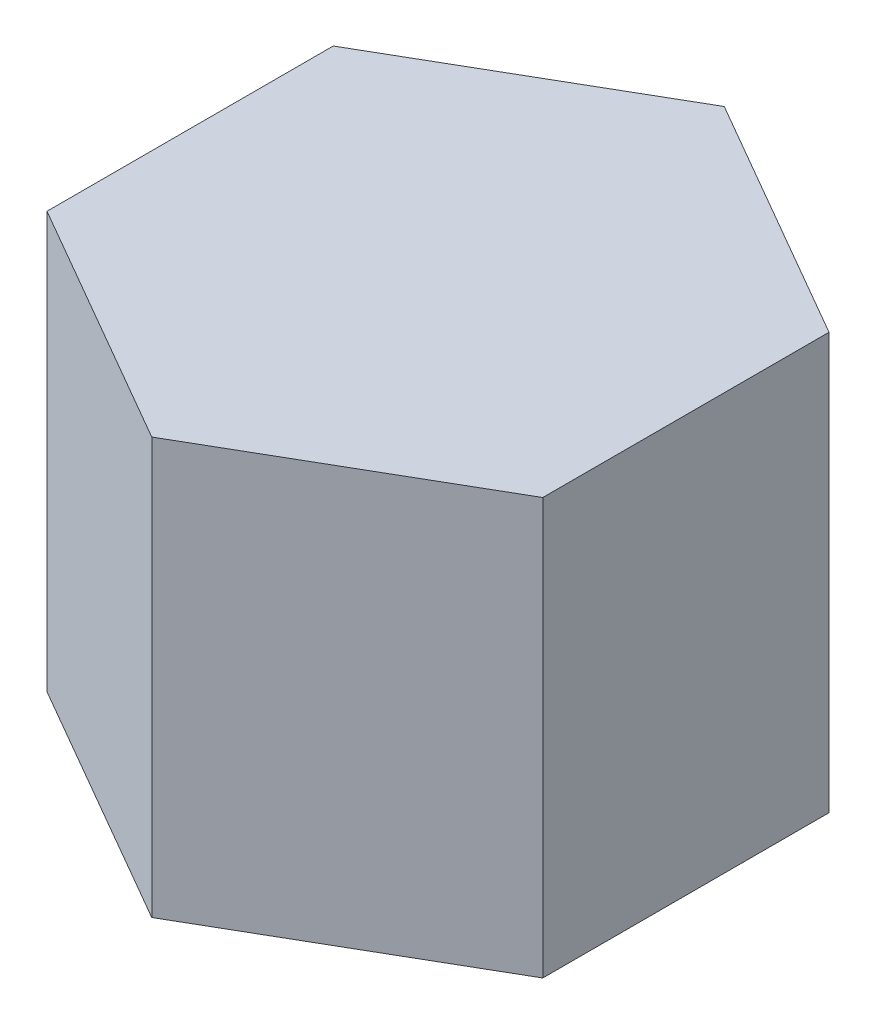
ISO-10303-21;
HEADER;
FILE_DESCRIPTION(('STEP AP214'),'2;1');
FILE_NAME('part.step','',(''),(''),'','','');
FILE_SCHEMA(('AUTOMOTIVE_DESIGN { 1 0 10303 214 1 1 1 1 }'));
ENDSEC;
DATA;
#1=APPLICATION_CONTEXT('core data for automotive mechanical design processes');
#2=APPLICATION_PROTOCOL_DEFINITION('international standard','automotive_design',2000,#1);
#3=PRODUCT_CONTEXT('',#1,'mechanical');
#4=PRODUCT('Part','Part','',(#3));
#5=PRODUCT_RELATED_PRODUCT_CATEGORY('part','',(#4));
#6=PRODUCT_DEFINITION_FORMATION('','',#4);
#7=PRODUCT_DEFINITION_CONTEXT('part definition',#1,'design');
#8=PRODUCT_DEFINITION('design','',#6,#7);
#9=PRODUCT_DEFINITION_SHAPE('','',#8);
#10=(LENGTH_UNIT() NAMED_UNIT(*) SI_UNIT(.MILLI.,.METRE.));
#11=(NAMED_UNIT(*) PLANE_ANGLE_UNIT() SI_UNIT($,.RADIAN.));
#12=(NAMED_UNIT(*) SI_UNIT($,.STERADIAN.) SOLID_ANGLE_UNIT());
#13=UNCERTAINTY_MEASURE_WITH_UNIT(LENGTH_MEASURE(1.E-05),#10,'distance_accuracy_value','');
#14=(GEOMETRIC_REPRESENTATION_CONTEXT(3) GLOBAL_UNCERTAINTY_ASSIGNED_CONTEXT((#13)) GLOBAL_UNIT_ASSIGNED_CONTEXT((#10,
#11,#12)) REPRESENTATION_CONTEXT('',''));
#15=CARTESIAN_POINT('',(0.,0.,0.));
#16=DIRECTION('',(0.,0.,1.));
#17=DIRECTION('',(1.,0.,0.));
#18=AXIS2_PLACEMENT_3D('',#15,#16,#17);
#19=CARTESIAN_POINT('',(202.839551417382,-147.556598747966,287.351844201572));
#20=DIRECTION('',(-0.499999999999943,0.,-0.866025403784471));
#21=DIRECTION('',(-0.866025403784471,0.,0.499999999999943));
#22=AXIS2_PLACEMENT_3D('',#19,#20,#21);
#23=PLANE('',#22);
#24=CARTESIAN_POINT('',(203.142660308706,-147.047793579175,287.176844201572));
#25=DIRECTION('',(-0.866025403784471,0.,0.499999999999943));
#26=VECTOR('',#25,1.);
#27=LINE('',#24,#26);
#28=CARTESIAN_POINT('',(203.142660308706,-147.047793579175,287.176844201572));
#29=VERTEX_POINT('',#28);
#30=CARTESIAN_POINT('',(202.839551417382,-147.047793579175,287.351844201572));
#31=VERTEX_POINT('',#30);
#32=EDGE_CURVE('E170',#29,#31,#27,.T.);
#33=ORIENTED_EDGE('',*,*,#32,.T.);
#34=CARTESIAN_POINT('',(202.839551417382,-147.556598747966,287.351844201572));
#35=DIRECTION('',(0.,1.,0.));
#36=VECTOR('',#35,1.);
#37=LINE('',#34,#36);
#38=CARTESIAN_POINT('',(202.839551417382,-147.556598747966,287.351844201572));
#39=VERTEX_POINT('',#38);
#40=EDGE_CURVE('E35',#39,#31,#37,.T.);
#41=ORIENTED_EDGE('',*,*,#40,.F.);
#42=CARTESIAN_POINT('',(203.142660308706,-147.556598747966,287.176844201572));
#43=DIRECTION('',(-0.866025403784471,0.,0.499999999999943));
#44=VECTOR('',#43,1.);
#45=LINE('',#42,#44);
#46=CARTESIAN_POINT('',(203.142660308706,-147.556598747966,287.176844201572));
#47=VERTEX_POINT('',#46);
#48=EDGE_CURVE('E159',#47,#39,#45,.T.);
#49=ORIENTED_EDGE('',*,*,#48,.F.);
#50=CARTESIAN_POINT('',(203.142660308706,-147.556598747966,287.176844201572));
#51=DIRECTION('',(0.,1.,0.));
#52=VECTOR('',#51,1.);
#53=LINE('',#50,#52);
#54=EDGE_CURVE('E10',#47,#29,#53,.T.);
#55=ORIENTED_EDGE('',*,*,#54,.T.);
#56=EDGE_LOOP('',(#33,#41,#49,#55));
#57=FACE_BOUND('',#56,.T.);
#58=ADVANCED_FACE('F16',(#57),#23,.F.);
#59=CARTESIAN_POINT('',(203.142660308706,-147.556598747966,291.594471220494));
#60=DIRECTION('',(-1.,0.,0.));
#61=DIRECTION('',(0.,-1.,0.));
#62=AXIS2_PLACEMENT_3D('',#59,#60,#61);
#63=PLANE('',#62);
#64=CARTESIAN_POINT('',(203.142660308706,-147.047793579175,286.826844201572));
#65=DIRECTION('',(0.,0.,1.));
#66=VECTOR('',#65,1.);
#67=LINE('',#64,#66);
#68=CARTESIAN_POINT('',(203.142660308706,-147.047793579175,286.826844201572));
#69=VERTEX_POINT('',#68);
#70=EDGE_CURVE('E167',#69,#29,#67,.T.);
#71=ORIENTED_EDGE('',*,*,#70,.T.);
#72=ORIENTED_EDGE('',*,*,#54,.F.);
#73=CARTESIAN_POINT('',(203.142660308706,-147.556598747966,286.826844201572));
#74=DIRECTION('',(0.,0.,1.));
#75=VECTOR('',#74,1.);
#76=LINE('',#73,#75);
#77=CARTESIAN_POINT('',(203.142660308706,-147.556598747966,286.826844201572));
#78=VERTEX_POINT('',#77);
#79=EDGE_CURVE('E156',#78,#47,#76,.T.);
#80=ORIENTED_EDGE('',*,*,#79,.F.);
#81=CARTESIAN_POINT('',(203.142660308706,-147.556598747966,286.826844201572));
#82=DIRECTION('',(0.,1.,0.));
#83=VECTOR('',#82,1.);
#84=LINE('',#81,#83);
#85=EDGE_CURVE('E27',#78,#69,#84,.T.);
#86=ORIENTED_EDGE('',*,*,#85,.T.);
#87=EDGE_LOOP('',(#71,#72,#80,#86));
#88=FACE_BOUND('',#87,.T.);
#89=ADVANCED_FACE('F189',(#88),#63,.F.);
#90=CARTESIAN_POINT('',(203.142660308706,-147.556598747966,286.826844201572));
#91=DIRECTION('',(-0.499999999999978,0.,0.866025403784452));
#92=DIRECTION('',(0.866025403784452,0.,0.499999999999978));
#93=AXIS2_PLACEMENT_3D('',#90,#91,#92);
#94=PLANE('',#93);
#95=CARTESIAN_POINT('',(202.839551417382,-147.047793579175,286.651844201572));
#96=DIRECTION('',(0.866025403784452,0.,0.499999999999978));
#97=VECTOR('',#96,1.);
#98=LINE('',#95,#97);
#99=CARTESIAN_POINT('',(202.839551417382,-147.047793579175,286.651844201572));
#100=VERTEX_POINT('',#99);
#101=EDGE_CURVE('E163',#100,#69,#98,.T.);
#102=ORIENTED_EDGE('',*,*,#101,.T.);
#103=ORIENTED_EDGE('',*,*,#85,.F.);
#104=CARTESIAN_POINT('',(202.839551417382,-147.556598747966,286.651844201572));
#105=DIRECTION('',(0.866025403784452,0.,0.499999999999978));
#106=VECTOR('',#105,1.);
#107=LINE('',#104,#106);
#108=CARTESIAN_POINT('',(202.839551417382,-147.556598747966,286.651844201572));
#109=VERTEX_POINT('',#108);
#110=EDGE_CURVE('E106',#109,#78,#107,.T.);
#111=ORIENTED_EDGE('',*,*,#110,.F.);
#112=CARTESIAN_POINT('',(202.839551417382,-147.556598747966,286.651844201572));
#113=DIRECTION('',(0.,1.,0.));
#114=VECTOR('',#113,1.);
#115=LINE('',#112,#114);
#116=EDGE_CURVE('E94',#109,#100,#115,.T.);
#117=ORIENTED_EDGE('',*,*,#116,.T.);
#118=EDGE_LOOP('',(#102,#103,#111,#117));
#119=FACE_BOUND('',#118,.T.);
#120=ADVANCED_FACE('F198',(#119),#94,.F.);
#121=CARTESIAN_POINT('',(202.839551417382,-147.556598747966,286.651844201572));
#122=DIRECTION('',(0.499999999999978,0.,0.866025403784452));
#123=DIRECTION('',(0.866025403784452,0.,-0.499999999999978));
#124=AXIS2_PLACEMENT_3D('',#121,#122,#123);
#125=PLANE('',#124);
#126=CARTESIAN_POINT('',(202.536442526057,-147.047793579175,286.826844201572));
#127=DIRECTION('',(0.866025403784452,0.,-0.499999999999978));
#128=VECTOR('',#127,1.);
#129=LINE('',#126,#128);
#130=CARTESIAN_POINT('',(202.536442526057,-147.047793579175,286.826844201572));
#131=VERTEX_POINT('',#130);
#132=EDGE_CURVE('E162',#131,#100,#129,.T.);
#133=ORIENTED_EDGE('',*,*,#132,.T.);
#134=ORIENTED_EDGE('',*,*,#116,.F.);
#135=CARTESIAN_POINT('',(202.536442526057,-147.556598747966,286.826844201572));
#136=DIRECTION('',(0.866025403784452,0.,-0.499999999999978));
#137=VECTOR('',#136,1.);
#138=LINE('',#135,#137);
#139=CARTESIAN_POINT('',(202.536442526057,-147.556598747966,286.826844201572));
#140=VERTEX_POINT('',#139);
#141=EDGE_CURVE('E98',#140,#109,#138,.T.);
#142=ORIENTED_EDGE('',*,*,#141,.F.);
#143=CARTESIAN_POINT('',(202.536442526057,-147.556598747966,286.826844201572));
#144=DIRECTION('',(0.,1.,0.));
#145=VECTOR('',#144,1.);
#146=LINE('',#143,#145);
#147=EDGE_CURVE('E79',#140,#131,#146,.T.);
#148=ORIENTED_EDGE('',*,*,#147,.T.);
#149=EDGE_LOOP('',(#133,#134,#142,#148));
#150=FACE_BOUND('',#149,.T.);
#151=ADVANCED_FACE('F100',(#150),#125,.F.);
#152=CARTESIAN_POINT('',(202.536442526057,-147.556598747966,291.594471220494));
#153=DIRECTION('',(1.,0.,0.));
#154=DIRECTION('',(0.,1.,0.));
#155=AXIS2_PLACEMENT_3D('',#152,#153,#154);
#156=PLANE('',#155);
#157=CARTESIAN_POINT('',(202.536442526057,-147.047793579175,287.176844201572));
#158=DIRECTION('',(0.,0.,-1.));
#159=VECTOR('',#158,1.);
#160=LINE('',#157,#159);
#161=CARTESIAN_POINT('',(202.536442526057,-147.047793579175,287.176844201572));
#162=VERTEX_POINT('',#161);
#163=EDGE_CURVE('E88',#162,#131,#160,.T.);
#164=ORIENTED_EDGE('',*,*,#163,.T.);
#165=ORIENTED_EDGE('',*,*,#147,.F.);
#166=CARTESIAN_POINT('',(202.536442526057,-147.556598747966,287.176844201572));
#167=DIRECTION('',(0.,0.,-1.));
#168=VECTOR('',#167,1.);
#169=LINE('',#166,#168);
#170=CARTESIAN_POINT('',(202.536442526057,-147.556598747966,287.176844201572));
#171=VERTEX_POINT('',#170);
#172=EDGE_CURVE('E84',#171,#140,#169,.T.);
#173=ORIENTED_EDGE('',*,*,#172,.F.);
#174=CARTESIAN_POINT('',(202.536442526057,-147.556598747966,287.176844201572));
#175=DIRECTION('',(0.,1.,0.));
#176=VECTOR('',#175,1.);
#177=LINE('',#174,#176);
#178=EDGE_CURVE('E58',#171,#162,#177,.T.);
#179=ORIENTED_EDGE('',*,*,#178,.T.);
#180=EDGE_LOOP('',(#164,#165,#173,#179));
#181=FACE_BOUND('',#180,.T.);
#182=ADVANCED_FACE('F82',(#181),#156,.F.);
#183=CARTESIAN_POINT('',(202.536442526057,-147.556598747966,287.176844201572));
#184=DIRECTION('',(0.499999999999943,0.,-0.866025403784471));
#185=DIRECTION('',(-0.866025403784471,0.,-0.499999999999943));
#186=AXIS2_PLACEMENT_3D('',#183,#184,#185);
#187=PLANE('',#186);
#188=CARTESIAN_POINT('',(202.839551417382,-147.047793579175,287.351844201572));
#189=DIRECTION('',(-0.866025403784471,0.,-0.499999999999943));
#190=VECTOR('',#189,1.);
#191=LINE('',#188,#190);
#192=EDGE_CURVE('E160',#31,#162,#191,.T.);
#193=ORIENTED_EDGE('',*,*,#192,.T.);
#194=ORIENTED_EDGE('',*,*,#178,.F.);
#195=CARTESIAN_POINT('',(202.839551417382,-147.556598747966,287.351844201572));
#196=DIRECTION('',(-0.866025403784471,0.,-0.499999999999943));
#197=VECTOR('',#196,1.);
#198=LINE('',#195,#197);
#199=EDGE_CURVE('E112',#39,#171,#198,.T.);
#200=ORIENTED_EDGE('',*,*,#199,.F.);
#201=ORIENTED_EDGE('',*,*,#40,.T.);
#202=EDGE_LOOP('',(#193,#194,#200,#201));
#203=FACE_BOUND('',#202,.T.);
#204=ADVANCED_FACE('F131',(#203),#187,.F.);
#205=CARTESIAN_POINT('',(206.491105863044,-147.556598747966,291.594471220494));
#206=DIRECTION('',(0.,1.,0.));
#207=DIRECTION('',(-1.,0.,0.));
#208=AXIS2_PLACEMENT_3D('',#205,#206,#207);
#209=PLANE('',#208);
#210=ORIENTED_EDGE('',*,*,#48,.T.);
#211=ORIENTED_EDGE('',*,*,#199,.T.);
#212=ORIENTED_EDGE('',*,*,#172,.T.);
#213=ORIENTED_EDGE('',*,*,#141,.T.);
#214=ORIENTED_EDGE('',*,*,#110,.T.);
#215=ORIENTED_EDGE('',*,*,#79,.T.);
#216=EDGE_LOOP('',(#210,#211,#212,#213,#214,#215));
#217=FACE_BOUND('',#216,.T.);
#218=ADVANCED_FACE('F111',(#217),#209,.F.);
#219=CARTESIAN_POINT('',(206.491105863044,-147.047793579175,291.594471220494));
#220=DIRECTION('',(0.,1.,0.));
#221=DIRECTION('',(-1.,0.,0.));
#222=AXIS2_PLACEMENT_3D('',#219,#220,#221);
#223=PLANE('',#222);
#224=ORIENTED_EDGE('',*,*,#32,.F.);
#225=ORIENTED_EDGE('',*,*,#70,.F.);
#226=ORIENTED_EDGE('',*,*,#101,.F.);
#227=ORIENTED_EDGE('',*,*,#132,.F.);
#228=ORIENTED_EDGE('',*,*,#163,.F.);
#229=ORIENTED_EDGE('',*,*,#192,.F.);
#230=EDGE_LOOP('',(#224,#225,#226,#227,#228,#229));
#231=FACE_BOUND('',#230,.T.);
#232=ADVANCED_FACE('F130',(#231),#223,.T.);
#233=CLOSED_SHELL('',(#58,#89,#120,#151,#182,#204,#218,#232));
#234=MANIFOLD_SOLID_BREP('B1',#233);
#235=ADVANCED_BREP_SHAPE_REPRESENTATION('',(#18,#234),#14);
#236=SHAPE_DEFINITION_REPRESENTATION(#9,#235);
ENDSEC;
END-ISO-10303-21;
